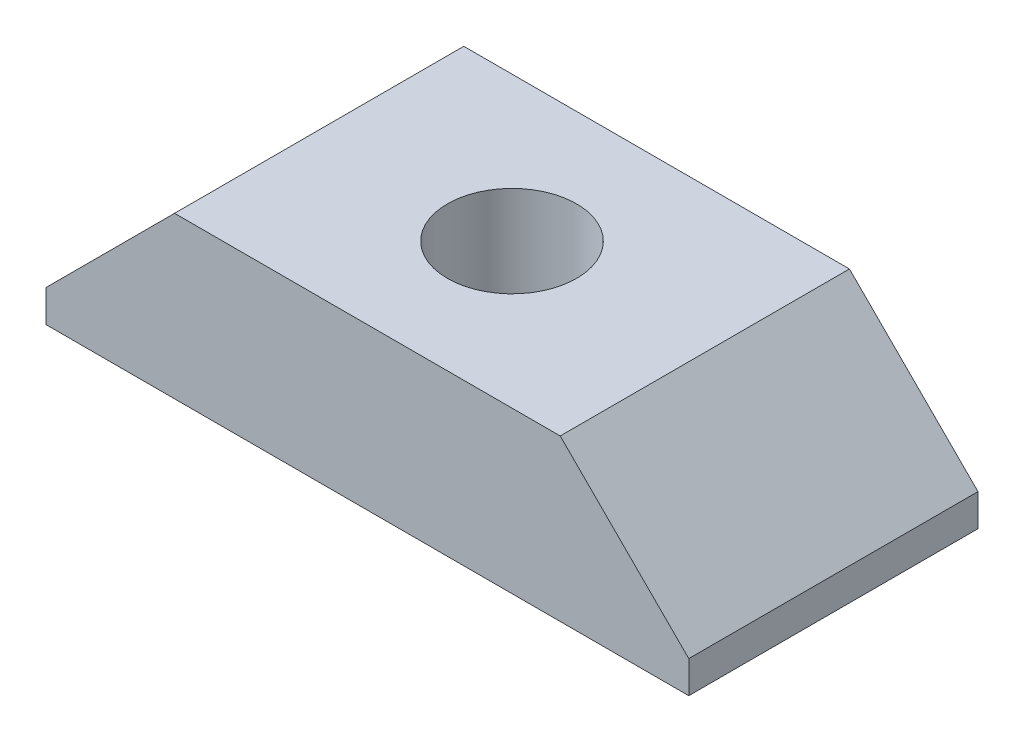
ISO-10303-21;
HEADER;
FILE_DESCRIPTION(('STEP AP214'),'2;1');
FILE_NAME('part.step','',(''),(''),'','','');
FILE_SCHEMA(('AUTOMOTIVE_DESIGN { 1 0 10303 214 1 1 1 1 }'));
ENDSEC;
DATA;
#1=APPLICATION_CONTEXT('core data for automotive mechanical design processes');
#2=APPLICATION_PROTOCOL_DEFINITION('international standard','automotive_design',2000,#1);
#3=PRODUCT_CONTEXT('',#1,'mechanical');
#4=PRODUCT('Part','Part','',(#3));
#5=PRODUCT_RELATED_PRODUCT_CATEGORY('part','',(#4));
#6=PRODUCT_DEFINITION_FORMATION('','',#4);
#7=PRODUCT_DEFINITION_CONTEXT('part definition',#1,'design');
#8=PRODUCT_DEFINITION('design','',#6,#7);
#9=PRODUCT_DEFINITION_SHAPE('','',#8);
#10=(LENGTH_UNIT() NAMED_UNIT(*) SI_UNIT(.MILLI.,.METRE.));
#11=(NAMED_UNIT(*) PLANE_ANGLE_UNIT() SI_UNIT($,.RADIAN.));
#12=(NAMED_UNIT(*) SI_UNIT($,.STERADIAN.) SOLID_ANGLE_UNIT());
#13=UNCERTAINTY_MEASURE_WITH_UNIT(LENGTH_MEASURE(1.E-05),#10,'distance_accuracy_value','');
#14=(GEOMETRIC_REPRESENTATION_CONTEXT(3) GLOBAL_UNCERTAINTY_ASSIGNED_CONTEXT((#13)) GLOBAL_UNIT_ASSIGNED_CONTEXT((#10,
#11,#12)) REPRESENTATION_CONTEXT('',''));
#15=CARTESIAN_POINT('',(0.,0.,0.));
#16=DIRECTION('',(0.,0.,1.));
#17=DIRECTION('',(1.,0.,0.));
#18=AXIS2_PLACEMENT_3D('',#15,#16,#17);
#19=CARTESIAN_POINT('',(12.7,-3.17499999999999,11.43));
#20=DIRECTION('',(-1.,0.,0.));
#21=DIRECTION('',(0.,0.,1.));
#22=AXIS2_PLACEMENT_3D('',#19,#20,#21);
#23=PLANE('',#22);
#24=DIRECTION('',(0.,1.,0.));
#25=VECTOR('',#24,1.);
#26=CARTESIAN_POINT('',(12.7,-3.175,0.));
#27=LINE('',#26,#25);
#28=CARTESIAN_POINT('',(12.7,-3.175,0.));
#29=VERTEX_POINT('',#28);
#30=CARTESIAN_POINT('',(12.7,-1.90500000000001,0.));
#31=VERTEX_POINT('',#30);
#32=EDGE_CURVE('E112',#29,#31,#27,.T.);
#33=ORIENTED_EDGE('',*,*,#32,.T.);
#34=DIRECTION('',(0.,0.,1.));
#35=VECTOR('',#34,1.);
#36=CARTESIAN_POINT('',(12.7,-1.90500000000001,11.43));
#37=LINE('',#36,#35);
#38=CARTESIAN_POINT('',(12.7,-1.90500000000001,11.43));
#39=VERTEX_POINT('',#38);
#40=EDGE_CURVE('E11',#31,#39,#37,.T.);
#41=ORIENTED_EDGE('',*,*,#40,.T.);
#42=DIRECTION('',(0.,1.,0.));
#43=VECTOR('',#42,1.);
#44=CARTESIAN_POINT('',(12.7,-3.17499999999999,11.43));
#45=LINE('',#44,#43);
#46=CARTESIAN_POINT('',(12.7,-3.17499999999999,11.43));
#47=VERTEX_POINT('',#46);
#48=EDGE_CURVE('E119',#47,#39,#45,.T.);
#49=ORIENTED_EDGE('',*,*,#48,.F.);
#50=DIRECTION('',(0.,0.,-1.));
#51=VECTOR('',#50,1.);
#52=CARTESIAN_POINT('',(12.7,-3.17499999999999,11.43));
#53=LINE('',#52,#51);
#54=EDGE_CURVE('E104',#47,#29,#53,.T.);
#55=ORIENTED_EDGE('',*,*,#54,.T.);
#56=EDGE_LOOP('',(#33,#41,#49,#55));
#57=FACE_BOUND('',#56,.T.);
#58=ADVANCED_FACE('F30',(#57),#23,.F.);
#59=CARTESIAN_POINT('',(-12.7,3.17500000000001,11.43));
#60=DIRECTION('',(0.,-1.,0.));
#61=DIRECTION('',(0.,0.,-1.));
#62=AXIS2_PLACEMENT_3D('',#59,#60,#61);
#63=PLANE('',#62);
#64=CARTESIAN_POINT('',(0.,3.175,5.715));
#65=DIRECTION('',(0.,1.,0.));
#66=DIRECTION('',(0.,0.,1.));
#67=AXIS2_PLACEMENT_3D('',#64,#65,#66);
#68=CIRCLE('',#67,2.5527);
#69=CARTESIAN_POINT('',(0.,3.175,8.2677));
#70=VERTEX_POINT('',#69);
#71=EDGE_CURVE('E143',#70,#70,#68,.T.);
#72=ORIENTED_EDGE('',*,*,#71,.F.);
#73=EDGE_LOOP('',(#72));
#74=FACE_BOUND('',#73,.T.);
#75=DIRECTION('',(-1.,0.,0.));
#76=VECTOR('',#75,1.);
#77=CARTESIAN_POINT('',(-12.7,3.175,0.));
#78=LINE('',#77,#76);
#79=CARTESIAN_POINT('',(7.61999999999999,3.175,0.));
#80=VERTEX_POINT('',#79);
#81=CARTESIAN_POINT('',(-7.62,3.17500000000001,0.));
#82=VERTEX_POINT('',#81);
#83=EDGE_CURVE('E114',#80,#82,#78,.T.);
#84=ORIENTED_EDGE('',*,*,#83,.T.);
#85=DIRECTION('',(0.,0.,1.));
#86=VECTOR('',#85,1.);
#87=CARTESIAN_POINT('',(-7.61999999999998,3.175,11.43));
#88=LINE('',#87,#86);
#89=CARTESIAN_POINT('',(-7.61999999999998,3.175,11.43));
#90=VERTEX_POINT('',#89);
#91=EDGE_CURVE('E51',#82,#90,#88,.T.);
#92=ORIENTED_EDGE('',*,*,#91,.T.);
#93=DIRECTION('',(-1.,0.,0.));
#94=VECTOR('',#93,1.);
#95=CARTESIAN_POINT('',(-12.7,3.17500000000001,11.43));
#96=LINE('',#95,#94);
#97=CARTESIAN_POINT('',(7.61999999999999,3.17500000000001,11.43));
#98=VERTEX_POINT('',#97);
#99=EDGE_CURVE('E94',#98,#90,#96,.T.);
#100=ORIENTED_EDGE('',*,*,#99,.F.);
#101=DIRECTION('',(0.,0.,-1.));
#102=VECTOR('',#101,1.);
#103=CARTESIAN_POINT('',(7.61999999999999,3.17500000000001,11.43));
#104=LINE('',#103,#102);
#105=EDGE_CURVE('E126',#98,#80,#104,.T.);
#106=ORIENTED_EDGE('',*,*,#105,.T.);
#107=EDGE_LOOP('',(#84,#92,#100,#106));
#108=FACE_BOUND('',#107,.T.);
#109=ADVANCED_FACE('F134',(#74,#108),#63,.F.);
#110=CARTESIAN_POINT('',(-12.7,-3.17499999999999,11.43));
#111=DIRECTION('',(1.,0.,0.));
#112=DIRECTION('',(0.,0.,-1.));
#113=AXIS2_PLACEMENT_3D('',#110,#111,#112);
#114=PLANE('',#113);
#115=DIRECTION('',(0.,-1.,0.));
#116=VECTOR('',#115,1.);
#117=CARTESIAN_POINT('',(-12.7,-3.17499999999999,11.43));
#118=LINE('',#117,#116);
#119=CARTESIAN_POINT('',(-12.7,-1.905,11.43));
#120=VERTEX_POINT('',#119);
#121=CARTESIAN_POINT('',(-12.7,-3.17499999999999,11.43));
#122=VERTEX_POINT('',#121);
#123=EDGE_CURVE('E84',#120,#122,#118,.T.);
#124=ORIENTED_EDGE('',*,*,#123,.F.);
#125=DIRECTION('',(0.,0.,-1.));
#126=VECTOR('',#125,1.);
#127=CARTESIAN_POINT('',(-12.7,-1.905,11.43));
#128=LINE('',#127,#126);
#129=CARTESIAN_POINT('',(-12.7,-1.905,0.));
#130=VERTEX_POINT('',#129);
#131=EDGE_CURVE('E103',#120,#130,#128,.T.);
#132=ORIENTED_EDGE('',*,*,#131,.T.);
#133=DIRECTION('',(0.,-1.,0.));
#134=VECTOR('',#133,1.);
#135=CARTESIAN_POINT('',(-12.7,-3.175,0.));
#136=LINE('',#135,#134);
#137=CARTESIAN_POINT('',(-12.7,-3.175,0.));
#138=VERTEX_POINT('',#137);
#139=EDGE_CURVE('E100',#130,#138,#136,.T.);
#140=ORIENTED_EDGE('',*,*,#139,.T.);
#141=DIRECTION('',(0.,0.,-1.));
#142=VECTOR('',#141,1.);
#143=CARTESIAN_POINT('',(-12.7,-3.17499999999999,11.43));
#144=LINE('',#143,#142);
#145=EDGE_CURVE('E97',#122,#138,#144,.T.);
#146=ORIENTED_EDGE('',*,*,#145,.F.);
#147=EDGE_LOOP('',(#124,#132,#140,#146));
#148=FACE_BOUND('',#147,.T.);
#149=ADVANCED_FACE('F98',(#148),#114,.F.);
#150=CARTESIAN_POINT('',(-12.7,-3.17499999999999,11.43));
#151=DIRECTION('',(0.,1.,0.));
#152=DIRECTION('',(0.,0.,1.));
#153=AXIS2_PLACEMENT_3D('',#150,#151,#152);
#154=PLANE('',#153);
#155=CARTESIAN_POINT('',(0.,-3.17499999999999,5.715));
#156=DIRECTION('',(0.,1.,0.));
#157=DIRECTION('',(0.,0.,1.));
#158=AXIS2_PLACEMENT_3D('',#155,#156,#157);
#159=CIRCLE('',#158,2.5527);
#160=CARTESIAN_POINT('',(0.,-3.17499999999999,8.2677));
#161=VERTEX_POINT('',#160);
#162=EDGE_CURVE('E115',#161,#161,#159,.T.);
#163=ORIENTED_EDGE('',*,*,#162,.T.);
#164=EDGE_LOOP('',(#163));
#165=FACE_BOUND('',#164,.T.);
#166=DIRECTION('',(1.,0.,0.));
#167=VECTOR('',#166,1.);
#168=CARTESIAN_POINT('',(-12.7,-3.175,0.));
#169=LINE('',#168,#167);
#170=EDGE_CURVE('E118',#138,#29,#169,.T.);
#171=ORIENTED_EDGE('',*,*,#170,.T.);
#172=ORIENTED_EDGE('',*,*,#54,.F.);
#173=DIRECTION('',(1.,0.,0.));
#174=VECTOR('',#173,1.);
#175=CARTESIAN_POINT('',(-12.7,-3.17499999999999,11.43));
#176=LINE('',#175,#174);
#177=EDGE_CURVE('E88',#122,#47,#176,.T.);
#178=ORIENTED_EDGE('',*,*,#177,.F.);
#179=ORIENTED_EDGE('',*,*,#145,.T.);
#180=EDGE_LOOP('',(#171,#172,#178,#179));
#181=FACE_BOUND('',#180,.T.);
#182=ADVANCED_FACE('F106',(#165,#181),#154,.F.);
#183=CARTESIAN_POINT('',(12.7,3.17500000000001,11.43));
#184=DIRECTION('',(0.,0.,-1.));
#185=DIRECTION('',(-1.,0.,0.));
#186=AXIS2_PLACEMENT_3D('',#183,#184,#185);
#187=PLANE('',#186);
#188=ORIENTED_EDGE('',*,*,#99,.T.);
#189=DIRECTION('',(0.707106781186549,0.707106781186546,0.));
#190=VECTOR('',#189,1.);
#191=CARTESIAN_POINT('',(-12.7,-1.905,11.43));
#192=LINE('',#191,#190);
#193=EDGE_CURVE('E38',#90,#120,#192,.F.);
#194=ORIENTED_EDGE('',*,*,#193,.T.);
#195=ORIENTED_EDGE('',*,*,#123,.T.);
#196=ORIENTED_EDGE('',*,*,#177,.T.);
#197=ORIENTED_EDGE('',*,*,#48,.T.);
#198=DIRECTION('',(0.707106781186546,-0.707106781186549,0.));
#199=VECTOR('',#198,1.);
#200=CARTESIAN_POINT('',(7.61999999999999,3.17500000000001,11.43));
#201=LINE('',#200,#199);
#202=EDGE_CURVE('E130',#39,#98,#201,.F.);
#203=ORIENTED_EDGE('',*,*,#202,.T.);
#204=EDGE_LOOP('',(#188,#194,#195,#196,#197,#203));
#205=FACE_BOUND('',#204,.T.);
#206=ADVANCED_FACE('F86',(#205),#187,.F.);
#207=CARTESIAN_POINT('',(12.7,3.175,0.));
#208=DIRECTION('',(0.,0.,-1.));
#209=DIRECTION('',(-1.,0.,0.));
#210=AXIS2_PLACEMENT_3D('',#207,#208,#209);
#211=PLANE('',#210);
#212=ORIENTED_EDGE('',*,*,#139,.F.);
#213=DIRECTION('',(-0.707106781186549,-0.707106781186546,0.));
#214=VECTOR('',#213,1.);
#215=CARTESIAN_POINT('',(2.54000000000004,13.335,0.));
#216=LINE('',#215,#214);
#217=EDGE_CURVE('E124',#130,#82,#216,.F.);
#218=ORIENTED_EDGE('',*,*,#217,.T.);
#219=ORIENTED_EDGE('',*,*,#83,.F.);
#220=DIRECTION('',(-0.707106781186546,0.707106781186549,0.));
#221=VECTOR('',#220,1.);
#222=CARTESIAN_POINT('',(10.16,0.635000000000004,0.));
#223=LINE('',#222,#221);
#224=EDGE_CURVE('E122',#80,#31,#223,.F.);
#225=ORIENTED_EDGE('',*,*,#224,.T.);
#226=ORIENTED_EDGE('',*,*,#32,.F.);
#227=ORIENTED_EDGE('',*,*,#170,.F.);
#228=EDGE_LOOP('',(#212,#218,#219,#225,#226,#227));
#229=FACE_BOUND('',#228,.T.);
#230=ADVANCED_FACE('F138',(#229),#211,.T.);
#231=CARTESIAN_POINT('',(-12.7,-1.905,11.43));
#232=DIRECTION('',(0.707106781186546,-0.707106781186549,0.));
#233=DIRECTION('',(0.707106781186549,0.707106781186546,0.));
#234=AXIS2_PLACEMENT_3D('',#231,#232,#233);
#235=PLANE('',#234);
#236=ORIENTED_EDGE('',*,*,#193,.F.);
#237=ORIENTED_EDGE('',*,*,#91,.F.);
#238=ORIENTED_EDGE('',*,*,#217,.F.);
#239=ORIENTED_EDGE('',*,*,#131,.F.);
#240=EDGE_LOOP('',(#236,#237,#238,#239));
#241=FACE_BOUND('',#240,.T.);
#242=ADVANCED_FACE('F158',(#241),#235,.F.);
#243=CARTESIAN_POINT('',(7.61999999999999,3.17500000000001,11.43));
#244=DIRECTION('',(-0.707106781186549,-0.707106781186546,0.));
#245=DIRECTION('',(0.707106781186546,-0.707106781186549,0.));
#246=AXIS2_PLACEMENT_3D('',#243,#244,#245);
#247=PLANE('',#246);
#248=ORIENTED_EDGE('',*,*,#202,.F.);
#249=ORIENTED_EDGE('',*,*,#40,.F.);
#250=ORIENTED_EDGE('',*,*,#224,.F.);
#251=ORIENTED_EDGE('',*,*,#105,.F.);
#252=EDGE_LOOP('',(#248,#249,#250,#251));
#253=FACE_BOUND('',#252,.T.);
#254=ADVANCED_FACE('F32',(#253),#247,.F.);
#255=CARTESIAN_POINT('',(0.,3.175,5.715));
#256=DIRECTION('',(0.,1.,0.));
#257=DIRECTION('',(0.,0.,1.));
#258=AXIS2_PLACEMENT_3D('',#255,#256,#257);
#259=CYLINDRICAL_SURFACE('',#258,2.5527);
#260=ORIENTED_EDGE('',*,*,#162,.F.);
#261=EDGE_LOOP('',(#260));
#262=FACE_BOUND('',#261,.T.);
#263=ORIENTED_EDGE('',*,*,#71,.T.);
#264=EDGE_LOOP('',(#263));
#265=FACE_BOUND('',#264,.T.);
#266=ADVANCED_FACE('F147',(#262,#265),#259,.F.);
#267=CLOSED_SHELL('',(#58,#109,#149,#182,#206,#230,#242,#254,#266));
#268=MANIFOLD_SOLID_BREP('B2',#267);
#269=ADVANCED_BREP_SHAPE_REPRESENTATION('',(#18,#268),#14);
#270=SHAPE_DEFINITION_REPRESENTATION(#9,#269);
ENDSEC;
END-ISO-10303-21;
